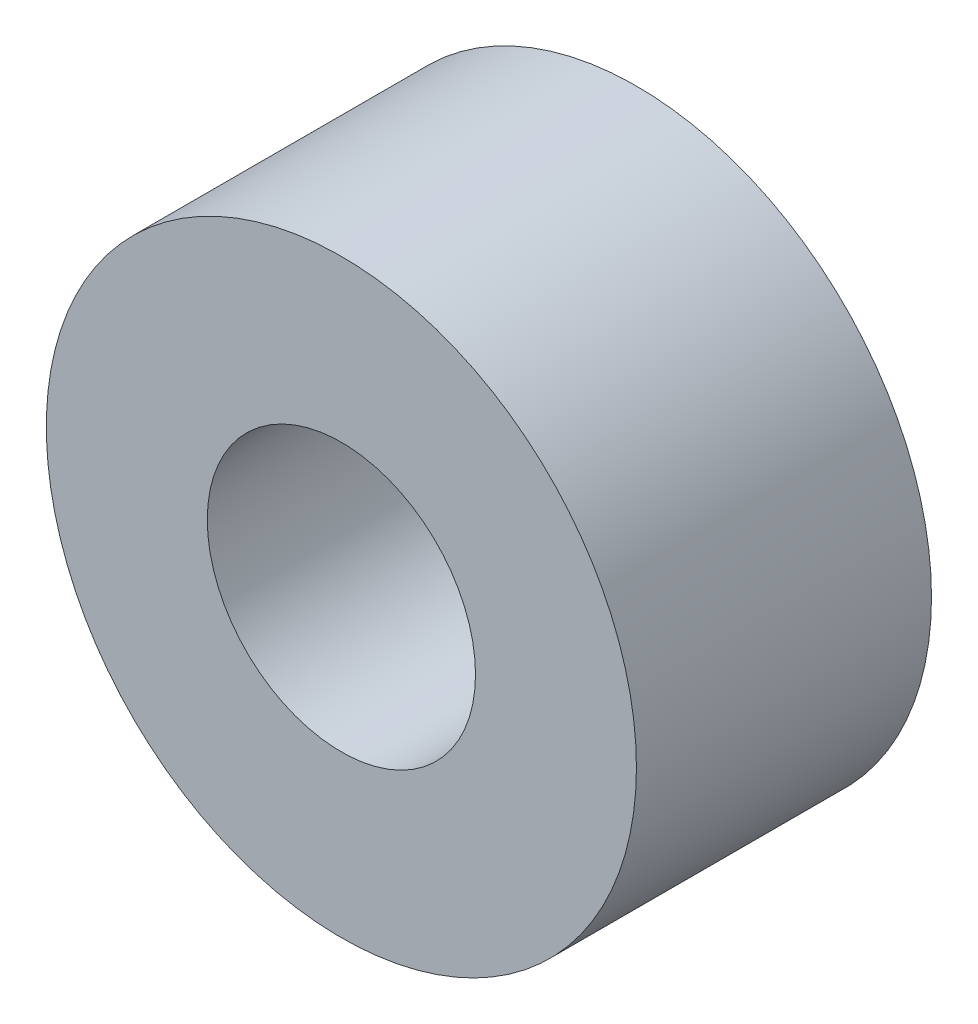
ISO-10303-21;
HEADER;
FILE_DESCRIPTION(('STEP AP214'),'2;1');
FILE_NAME('part.step','',(''),(''),'','','');
FILE_SCHEMA(('AUTOMOTIVE_DESIGN { 1 0 10303 214 1 1 1 1 }'));
ENDSEC;
DATA;
#1=APPLICATION_CONTEXT('core data for automotive mechanical design processes');
#2=APPLICATION_PROTOCOL_DEFINITION('international standard','automotive_design',2000,#1);
#3=PRODUCT_CONTEXT('',#1,'mechanical');
#4=PRODUCT('Part','Part','',(#3));
#5=PRODUCT_RELATED_PRODUCT_CATEGORY('part','',(#4));
#6=PRODUCT_DEFINITION_FORMATION('','',#4);
#7=PRODUCT_DEFINITION_CONTEXT('part definition',#1,'design');
#8=PRODUCT_DEFINITION('design','',#6,#7);
#9=PRODUCT_DEFINITION_SHAPE('','',#8);
#10=(LENGTH_UNIT() NAMED_UNIT(*) SI_UNIT(.MILLI.,.METRE.));
#11=(NAMED_UNIT(*) PLANE_ANGLE_UNIT() SI_UNIT($,.RADIAN.));
#12=(NAMED_UNIT(*) SI_UNIT($,.STERADIAN.) SOLID_ANGLE_UNIT());
#13=UNCERTAINTY_MEASURE_WITH_UNIT(LENGTH_MEASURE(1.E-05),#10,'distance_accuracy_value','');
#14=(GEOMETRIC_REPRESENTATION_CONTEXT(3) GLOBAL_UNCERTAINTY_ASSIGNED_CONTEXT((#13)) GLOBAL_UNIT_ASSIGNED_CONTEXT((#10,
#11,#12)) REPRESENTATION_CONTEXT('',''));
#15=CARTESIAN_POINT('',(0.,0.,0.));
#16=DIRECTION('',(0.,0.,1.));
#17=DIRECTION('',(1.,0.,0.));
#18=AXIS2_PLACEMENT_3D('',#15,#16,#17);
#19=CARTESIAN_POINT('',(0.,0.,5.5));
#20=DIRECTION('',(0.,0.,1.));
#21=DIRECTION('',(1.,0.,0.));
#22=AXIS2_PLACEMENT_3D('',#19,#20,#21);
#23=PLANE('',#22);
#24=CARTESIAN_POINT('',(0.,0.,5.5));
#25=DIRECTION('',(0.,0.,1.));
#26=DIRECTION('',(1.,0.,0.));
#27=AXIS2_PLACEMENT_3D('',#24,#25,#26);
#28=CIRCLE('',#27,5.5);
#29=CARTESIAN_POINT('',(5.5,0.,5.5));
#30=VERTEX_POINT('',#29);
#31=EDGE_CURVE('E10',#30,#30,#28,.T.);
#32=ORIENTED_EDGE('',*,*,#31,.T.);
#33=EDGE_LOOP('',(#32));
#34=FACE_BOUND('',#33,.T.);
#35=CARTESIAN_POINT('',(0.,0.,5.5));
#36=DIRECTION('',(0.,0.,1.));
#37=DIRECTION('',(1.,0.,0.));
#38=AXIS2_PLACEMENT_3D('',#35,#36,#37);
#39=CIRCLE('',#38,2.5);
#40=CARTESIAN_POINT('',(2.5,0.,5.5));
#41=VERTEX_POINT('',#40);
#42=EDGE_CURVE('E46',#41,#41,#39,.T.);
#43=ORIENTED_EDGE('',*,*,#42,.F.);
#44=EDGE_LOOP('',(#43));
#45=FACE_BOUND('',#44,.T.);
#46=ADVANCED_FACE('F35',(#34,#45),#23,.T.);
#47=CARTESIAN_POINT('',(0.,0.,0.));
#48=DIRECTION('',(0.,0.,1.));
#49=DIRECTION('',(1.,0.,0.));
#50=AXIS2_PLACEMENT_3D('',#47,#48,#49);
#51=PLANE('',#50);
#52=CARTESIAN_POINT('',(0.,0.,0.));
#53=DIRECTION('',(0.,0.,1.));
#54=DIRECTION('',(1.,0.,0.));
#55=AXIS2_PLACEMENT_3D('',#52,#53,#54);
#56=CIRCLE('',#55,5.5);
#57=CARTESIAN_POINT('',(5.5,0.,0.));
#58=VERTEX_POINT('',#57);
#59=EDGE_CURVE('E39',#58,#58,#56,.T.);
#60=ORIENTED_EDGE('',*,*,#59,.F.);
#61=EDGE_LOOP('',(#60));
#62=FACE_BOUND('',#61,.T.);
#63=CARTESIAN_POINT('',(0.,0.,0.));
#64=DIRECTION('',(0.,0.,1.));
#65=DIRECTION('',(1.,0.,0.));
#66=AXIS2_PLACEMENT_3D('',#63,#64,#65);
#67=CIRCLE('',#66,2.5);
#68=CARTESIAN_POINT('',(2.5,0.,0.));
#69=VERTEX_POINT('',#68);
#70=EDGE_CURVE('E48',#69,#69,#67,.T.);
#71=ORIENTED_EDGE('',*,*,#70,.T.);
#72=EDGE_LOOP('',(#71));
#73=FACE_BOUND('',#72,.T.);
#74=ADVANCED_FACE('F58',(#62,#73),#51,.F.);
#75=CARTESIAN_POINT('',(0.,0.,5.5));
#76=DIRECTION('',(0.,0.,-1.));
#77=DIRECTION('',(-1.,0.,0.));
#78=AXIS2_PLACEMENT_3D('',#75,#76,#77);
#79=CYLINDRICAL_SURFACE('',#78,5.5);
#80=ORIENTED_EDGE('',*,*,#31,.F.);
#81=EDGE_LOOP('',(#80));
#82=FACE_BOUND('',#81,.T.);
#83=ORIENTED_EDGE('',*,*,#59,.T.);
#84=EDGE_LOOP('',(#83));
#85=FACE_BOUND('',#84,.T.);
#86=ADVANCED_FACE('F37',(#82,#85),#79,.T.);
#87=CARTESIAN_POINT('',(0.,0.,5.5));
#88=DIRECTION('',(0.,0.,-1.));
#89=DIRECTION('',(-1.,0.,0.));
#90=AXIS2_PLACEMENT_3D('',#87,#88,#89);
#91=CYLINDRICAL_SURFACE('',#90,2.5);
#92=ORIENTED_EDGE('',*,*,#42,.T.);
#93=EDGE_LOOP('',(#92));
#94=FACE_BOUND('',#93,.T.);
#95=ORIENTED_EDGE('',*,*,#70,.F.);
#96=EDGE_LOOP('',(#95));
#97=FACE_BOUND('',#96,.T.);
#98=ADVANCED_FACE('F54',(#94,#97),#91,.F.);
#99=CLOSED_SHELL('',(#46,#74,#86,#98));
#100=MANIFOLD_SOLID_BREP('B2',#99);
#101=ADVANCED_BREP_SHAPE_REPRESENTATION('',(#18,#100),#14);
#102=SHAPE_DEFINITION_REPRESENTATION(#9,#101);
ENDSEC;
END-ISO-10303-21;
